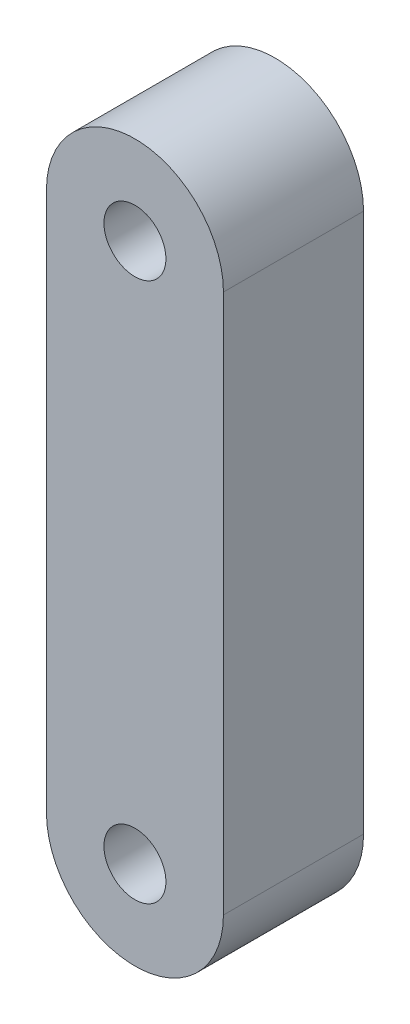
ISO-10303-21;
HEADER;
FILE_DESCRIPTION(('STEP AP214'),'2;1');
FILE_NAME('part.step','',(''),(''),'','','');
FILE_SCHEMA(('AUTOMOTIVE_DESIGN { 1 0 10303 214 1 1 1 1 }'));
ENDSEC;
DATA;
#1=APPLICATION_CONTEXT('core data for automotive mechanical design processes');
#2=APPLICATION_PROTOCOL_DEFINITION('international standard','automotive_design',2000,#1);
#3=PRODUCT_CONTEXT('',#1,'mechanical');
#4=PRODUCT('Part','Part','',(#3));
#5=PRODUCT_RELATED_PRODUCT_CATEGORY('part','',(#4));
#6=PRODUCT_DEFINITION_FORMATION('','',#4);
#7=PRODUCT_DEFINITION_CONTEXT('part definition',#1,'design');
#8=PRODUCT_DEFINITION('design','',#6,#7);
#9=PRODUCT_DEFINITION_SHAPE('','',#8);
#10=(LENGTH_UNIT() NAMED_UNIT(*) SI_UNIT(.MILLI.,.METRE.));
#11=(NAMED_UNIT(*) PLANE_ANGLE_UNIT() SI_UNIT($,.RADIAN.));
#12=(NAMED_UNIT(*) SI_UNIT($,.STERADIAN.) SOLID_ANGLE_UNIT());
#13=UNCERTAINTY_MEASURE_WITH_UNIT(LENGTH_MEASURE(1.E-05),#10,'distance_accuracy_value','');
#14=(GEOMETRIC_REPRESENTATION_CONTEXT(3) GLOBAL_UNCERTAINTY_ASSIGNED_CONTEXT((#13)) GLOBAL_UNIT_ASSIGNED_CONTEXT((#10,
#11,#12)) REPRESENTATION_CONTEXT('',''));
#15=CARTESIAN_POINT('',(0.,0.,0.));
#16=DIRECTION('',(0.,0.,1.));
#17=DIRECTION('',(1.,0.,0.));
#18=AXIS2_PLACEMENT_3D('',#15,#16,#17);
#19=CARTESIAN_POINT('',(-83.652318909,-56.622659468,0.));
#20=DIRECTION('',(0.,0.,1.));
#21=DIRECTION('',(1.,0.,0.));
#22=AXIS2_PLACEMENT_3D('',#19,#20,#21);
#23=CYLINDRICAL_SURFACE('',#22,6.00000000000001);
#24=CARTESIAN_POINT('',(-83.652318909,-56.622659468,9.5));
#25=DIRECTION('',(0.,0.,1.));
#26=DIRECTION('',(1.,0.,0.));
#27=AXIS2_PLACEMENT_3D('',#24,#25,#26);
#28=CIRCLE('',#27,6.00000000000001);
#29=CARTESIAN_POINT('',(-89.652318909,-56.622659468,9.5));
#30=VERTEX_POINT('',#29);
#31=CARTESIAN_POINT('',(-77.652318909,-56.622659468,9.5));
#32=VERTEX_POINT('',#31);
#33=EDGE_CURVE('E97',#30,#32,#28,.T.);
#34=ORIENTED_EDGE('',*,*,#33,.F.);
#35=DIRECTION('',(0.,0.,1.));
#36=VECTOR('',#35,1.);
#37=CARTESIAN_POINT('',(-89.652318909,-56.622659468,0.));
#38=LINE('',#37,#36);
#39=CARTESIAN_POINT('',(-89.652318909,-56.622659468,0.));
#40=VERTEX_POINT('',#39);
#41=EDGE_CURVE('E11',#40,#30,#38,.T.);
#42=ORIENTED_EDGE('',*,*,#41,.F.);
#43=CARTESIAN_POINT('',(-83.652318909,-56.622659468,0.));
#44=DIRECTION('',(0.,0.,1.));
#45=DIRECTION('',(1.,0.,0.));
#46=AXIS2_PLACEMENT_3D('',#43,#44,#45);
#47=CIRCLE('',#46,6.00000000000001);
#48=CARTESIAN_POINT('',(-77.652318909,-56.622659468,0.));
#49=VERTEX_POINT('',#48);
#50=EDGE_CURVE('E90',#40,#49,#47,.T.);
#51=ORIENTED_EDGE('',*,*,#50,.T.);
#52=DIRECTION('',(0.,0.,1.));
#53=VECTOR('',#52,1.);
#54=CARTESIAN_POINT('',(-77.652318909,-56.622659468,0.));
#55=LINE('',#54,#53);
#56=EDGE_CURVE('E35',#49,#32,#55,.T.);
#57=ORIENTED_EDGE('',*,*,#56,.T.);
#58=EDGE_LOOP('',(#34,#42,#51,#57));
#59=FACE_BOUND('',#58,.T.);
#60=ADVANCED_FACE('F32',(#59),#23,.T.);
#61=CARTESIAN_POINT('',(-89.652318909,-20.044841126,0.));
#62=DIRECTION('',(-1.,0.,0.));
#63=DIRECTION('',(0.,0.,1.));
#64=AXIS2_PLACEMENT_3D('',#61,#62,#63);
#65=PLANE('',#64);
#66=DIRECTION('',(0.,-1.,0.));
#67=VECTOR('',#66,1.);
#68=CARTESIAN_POINT('',(-89.652318909,-20.044841126,9.5));
#69=LINE('',#68,#67);
#70=CARTESIAN_POINT('',(-89.652318909,-20.044841126,9.5));
#71=VERTEX_POINT('',#70);
#72=EDGE_CURVE('E92',#71,#30,#69,.T.);
#73=ORIENTED_EDGE('',*,*,#72,.F.);
#74=DIRECTION('',(0.,0.,1.));
#75=VECTOR('',#74,1.);
#76=CARTESIAN_POINT('',(-89.652318909,-20.044841126,0.));
#77=LINE('',#76,#75);
#78=CARTESIAN_POINT('',(-89.652318909,-20.044841126,0.));
#79=VERTEX_POINT('',#78);
#80=EDGE_CURVE('E41',#79,#71,#77,.T.);
#81=ORIENTED_EDGE('',*,*,#80,.F.);
#82=DIRECTION('',(0.,-1.,0.));
#83=VECTOR('',#82,1.);
#84=CARTESIAN_POINT('',(-89.652318909,-20.044841126,0.));
#85=LINE('',#84,#83);
#86=EDGE_CURVE('E87',#79,#40,#85,.T.);
#87=ORIENTED_EDGE('',*,*,#86,.T.);
#88=ORIENTED_EDGE('',*,*,#41,.T.);
#89=EDGE_LOOP('',(#73,#81,#87,#88));
#90=FACE_BOUND('',#89,.T.);
#91=ADVANCED_FACE('F108',(#90),#65,.T.);
#92=CARTESIAN_POINT('',(-83.652318909,-20.044841126,0.));
#93=DIRECTION('',(0.,0.,1.));
#94=DIRECTION('',(1.,0.,0.));
#95=AXIS2_PLACEMENT_3D('',#92,#93,#94);
#96=CYLINDRICAL_SURFACE('',#95,6.00000000000001);
#97=CARTESIAN_POINT('',(-83.652318909,-20.044841126,9.5));
#98=DIRECTION('',(0.,0.,1.));
#99=DIRECTION('',(1.,0.,0.));
#100=AXIS2_PLACEMENT_3D('',#97,#98,#99);
#101=CIRCLE('',#100,6.00000000000001);
#102=CARTESIAN_POINT('',(-77.652318909,-20.044841126,9.5));
#103=VERTEX_POINT('',#102);
#104=EDGE_CURVE('E82',#103,#71,#101,.T.);
#105=ORIENTED_EDGE('',*,*,#104,.F.);
#106=DIRECTION('',(0.,0.,1.));
#107=VECTOR('',#106,1.);
#108=CARTESIAN_POINT('',(-77.652318909,-20.044841126,0.));
#109=LINE('',#108,#107);
#110=CARTESIAN_POINT('',(-77.652318909,-20.044841126,0.));
#111=VERTEX_POINT('',#110);
#112=EDGE_CURVE('E77',#111,#103,#109,.T.);
#113=ORIENTED_EDGE('',*,*,#112,.F.);
#114=CARTESIAN_POINT('',(-83.652318909,-20.044841126,0.));
#115=DIRECTION('',(0.,0.,1.));
#116=DIRECTION('',(1.,0.,0.));
#117=AXIS2_PLACEMENT_3D('',#114,#115,#116);
#118=CIRCLE('',#117,6.00000000000001);
#119=EDGE_CURVE('E80',#111,#79,#118,.T.);
#120=ORIENTED_EDGE('',*,*,#119,.T.);
#121=ORIENTED_EDGE('',*,*,#80,.T.);
#122=EDGE_LOOP('',(#105,#113,#120,#121));
#123=FACE_BOUND('',#122,.T.);
#124=ADVANCED_FACE('F79',(#123),#96,.T.);
#125=CARTESIAN_POINT('',(-77.652318909,-56.622659468,0.));
#126=DIRECTION('',(1.,0.,0.));
#127=DIRECTION('',(0.,0.,-1.));
#128=AXIS2_PLACEMENT_3D('',#125,#126,#127);
#129=PLANE('',#128);
#130=DIRECTION('',(0.,1.,0.));
#131=VECTOR('',#130,1.);
#132=CARTESIAN_POINT('',(-77.652318909,-56.622659468,9.5));
#133=LINE('',#132,#131);
#134=EDGE_CURVE('E100',#32,#103,#133,.T.);
#135=ORIENTED_EDGE('',*,*,#134,.F.);
#136=ORIENTED_EDGE('',*,*,#56,.F.);
#137=DIRECTION('',(0.,1.,0.));
#138=VECTOR('',#137,1.);
#139=CARTESIAN_POINT('',(-77.652318909,-56.622659468,0.));
#140=LINE('',#139,#138);
#141=EDGE_CURVE('E86',#49,#111,#140,.T.);
#142=ORIENTED_EDGE('',*,*,#141,.T.);
#143=ORIENTED_EDGE('',*,*,#112,.T.);
#144=EDGE_LOOP('',(#135,#136,#142,#143));
#145=FACE_BOUND('',#144,.T.);
#146=ADVANCED_FACE('F89',(#145),#129,.T.);
#147=CARTESIAN_POINT('',(-83.652318909,-56.622659468,0.));
#148=DIRECTION('',(0.,0.,1.));
#149=DIRECTION('',(1.,0.,0.));
#150=AXIS2_PLACEMENT_3D('',#147,#148,#149);
#151=PLANE('',#150);
#152=CARTESIAN_POINT('',(-83.652318909,-20.044841126,0.));
#153=DIRECTION('',(0.,0.,1.));
#154=DIRECTION('',(-1.,0.,0.));
#155=AXIS2_PLACEMENT_3D('',#152,#153,#154);
#156=CIRCLE('',#155,2.1);
#157=CARTESIAN_POINT('',(-85.752318909,-20.044841126,0.));
#158=VERTEX_POINT('',#157);
#159=EDGE_CURVE('E141',#158,#158,#156,.T.);
#160=ORIENTED_EDGE('',*,*,#159,.T.);
#161=EDGE_LOOP('',(#160));
#162=FACE_BOUND('',#161,.T.);
#163=CARTESIAN_POINT('',(-83.652318909,-56.622659468,0.));
#164=DIRECTION('',(0.,0.,1.));
#165=DIRECTION('',(-1.,0.,0.));
#166=AXIS2_PLACEMENT_3D('',#163,#164,#165);
#167=CIRCLE('',#166,2.1);
#168=CARTESIAN_POINT('',(-85.752318909,-56.622659468,0.));
#169=VERTEX_POINT('',#168);
#170=EDGE_CURVE('E101',#169,#169,#167,.T.);
#171=ORIENTED_EDGE('',*,*,#170,.T.);
#172=EDGE_LOOP('',(#171));
#173=FACE_BOUND('',#172,.T.);
#174=ORIENTED_EDGE('',*,*,#50,.F.);
#175=ORIENTED_EDGE('',*,*,#86,.F.);
#176=ORIENTED_EDGE('',*,*,#119,.F.);
#177=ORIENTED_EDGE('',*,*,#141,.F.);
#178=EDGE_LOOP('',(#174,#175,#176,#177));
#179=FACE_BOUND('',#178,.T.);
#180=ADVANCED_FACE('F85',(#162,#173,#179),#151,.F.);
#181=CARTESIAN_POINT('',(-83.652318909,-56.622659468,9.5));
#182=DIRECTION('',(0.,0.,1.));
#183=DIRECTION('',(1.,0.,0.));
#184=AXIS2_PLACEMENT_3D('',#181,#182,#183);
#185=PLANE('',#184);
#186=CARTESIAN_POINT('',(-83.652318909,-20.044841126,9.5));
#187=DIRECTION('',(0.,0.,1.));
#188=DIRECTION('',(-1.,0.,0.));
#189=AXIS2_PLACEMENT_3D('',#186,#187,#188);
#190=CIRCLE('',#189,2.1);
#191=CARTESIAN_POINT('',(-85.752318909,-20.044841126,9.5));
#192=VERTEX_POINT('',#191);
#193=EDGE_CURVE('E144',#192,#192,#190,.T.);
#194=ORIENTED_EDGE('',*,*,#193,.F.);
#195=EDGE_LOOP('',(#194));
#196=FACE_BOUND('',#195,.T.);
#197=CARTESIAN_POINT('',(-83.652318909,-56.622659468,9.5));
#198=DIRECTION('',(0.,0.,1.));
#199=DIRECTION('',(-1.,0.,0.));
#200=AXIS2_PLACEMENT_3D('',#197,#198,#199);
#201=CIRCLE('',#200,2.1);
#202=CARTESIAN_POINT('',(-85.752318909,-56.622659468,9.5));
#203=VERTEX_POINT('',#202);
#204=EDGE_CURVE('E146',#203,#203,#201,.T.);
#205=ORIENTED_EDGE('',*,*,#204,.F.);
#206=EDGE_LOOP('',(#205));
#207=FACE_BOUND('',#206,.T.);
#208=ORIENTED_EDGE('',*,*,#33,.T.);
#209=ORIENTED_EDGE('',*,*,#134,.T.);
#210=ORIENTED_EDGE('',*,*,#104,.T.);
#211=ORIENTED_EDGE('',*,*,#72,.T.);
#212=EDGE_LOOP('',(#208,#209,#210,#211));
#213=FACE_BOUND('',#212,.T.);
#214=ADVANCED_FACE('F107',(#196,#207,#213),#185,.T.);
#215=CARTESIAN_POINT('',(-83.652318909,-56.622659468,0.));
#216=DIRECTION('',(0.,0.,1.));
#217=DIRECTION('',(1.,0.,0.));
#218=AXIS2_PLACEMENT_3D('',#215,#216,#217);
#219=CYLINDRICAL_SURFACE('',#218,2.1);
#220=ORIENTED_EDGE('',*,*,#170,.F.);
#221=EDGE_LOOP('',(#220));
#222=FACE_BOUND('',#221,.T.);
#223=ORIENTED_EDGE('',*,*,#204,.T.);
#224=EDGE_LOOP('',(#223));
#225=FACE_BOUND('',#224,.T.);
#226=ADVANCED_FACE('F126',(#222,#225),#219,.F.);
#227=CARTESIAN_POINT('',(-83.652318909,-20.044841126,0.));
#228=DIRECTION('',(0.,0.,1.));
#229=DIRECTION('',(1.,0.,0.));
#230=AXIS2_PLACEMENT_3D('',#227,#228,#229);
#231=CYLINDRICAL_SURFACE('',#230,2.1);
#232=ORIENTED_EDGE('',*,*,#159,.F.);
#233=EDGE_LOOP('',(#232));
#234=FACE_BOUND('',#233,.T.);
#235=ORIENTED_EDGE('',*,*,#193,.T.);
#236=EDGE_LOOP('',(#235));
#237=FACE_BOUND('',#236,.T.);
#238=ADVANCED_FACE('F133',(#234,#237),#231,.F.);
#239=CLOSED_SHELL('',(#60,#91,#124,#146,#180,#214,#226,#238));
#240=MANIFOLD_SOLID_BREP('B2',#239);
#241=ADVANCED_BREP_SHAPE_REPRESENTATION('',(#18,#240),#14);
#242=SHAPE_DEFINITION_REPRESENTATION(#9,#241);
ENDSEC;
END-ISO-10303-21;
